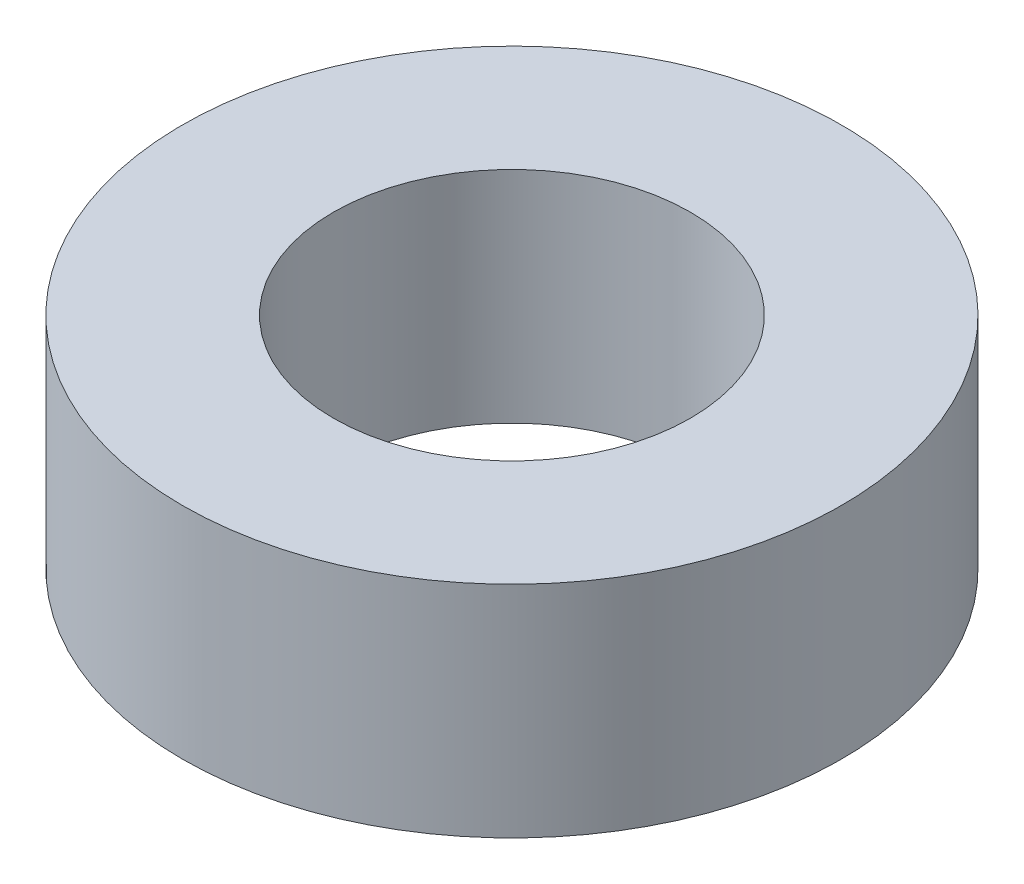
ISO-10303-21;
HEADER;
FILE_DESCRIPTION(('STEP AP214'),'2;1');
FILE_NAME('part.step','',(''),(''),'','','');
FILE_SCHEMA(('AUTOMOTIVE_DESIGN { 1 0 10303 214 1 1 1 1 }'));
ENDSEC;
DATA;
#1=APPLICATION_CONTEXT('core data for automotive mechanical design processes');
#2=APPLICATION_PROTOCOL_DEFINITION('international standard','automotive_design',2000,#1);
#3=PRODUCT_CONTEXT('',#1,'mechanical');
#4=PRODUCT('Part','Part','',(#3));
#5=PRODUCT_RELATED_PRODUCT_CATEGORY('part','',(#4));
#6=PRODUCT_DEFINITION_FORMATION('','',#4);
#7=PRODUCT_DEFINITION_CONTEXT('part definition',#1,'design');
#8=PRODUCT_DEFINITION('design','',#6,#7);
#9=PRODUCT_DEFINITION_SHAPE('','',#8);
#10=(LENGTH_UNIT() NAMED_UNIT(*) SI_UNIT(.MILLI.,.METRE.));
#11=(NAMED_UNIT(*) PLANE_ANGLE_UNIT() SI_UNIT($,.RADIAN.));
#12=(NAMED_UNIT(*) SI_UNIT($,.STERADIAN.) SOLID_ANGLE_UNIT());
#13=UNCERTAINTY_MEASURE_WITH_UNIT(LENGTH_MEASURE(1.E-05),#10,'distance_accuracy_value','');
#14=(GEOMETRIC_REPRESENTATION_CONTEXT(3) GLOBAL_UNCERTAINTY_ASSIGNED_CONTEXT((#13)) GLOBAL_UNIT_ASSIGNED_CONTEXT((#10,
#11,#12)) REPRESENTATION_CONTEXT('',''));
#15=CARTESIAN_POINT('',(0.,0.,0.));
#16=DIRECTION('',(0.,0.,1.));
#17=DIRECTION('',(1.,0.,0.));
#18=AXIS2_PLACEMENT_3D('',#15,#16,#17);
#19=CARTESIAN_POINT('',(0.,4.,0.));
#20=DIRECTION('',(0.,1.,0.));
#21=DIRECTION('',(0.,0.,1.));
#22=AXIS2_PLACEMENT_3D('',#19,#20,#21);
#23=PLANE('',#22);
#24=CARTESIAN_POINT('',(0.,4.,0.));
#25=DIRECTION('',(0.,1.,0.));
#26=DIRECTION('',(0.,0.,1.));
#27=AXIS2_PLACEMENT_3D('',#24,#25,#26);
#28=CIRCLE('',#27,6.);
#29=CARTESIAN_POINT('',(0.,4.,6.));
#30=VERTEX_POINT('',#29);
#31=EDGE_CURVE('E10',#30,#30,#28,.T.);
#32=ORIENTED_EDGE('',*,*,#31,.T.);
#33=EDGE_LOOP('',(#32));
#34=FACE_BOUND('',#33,.T.);
#35=CARTESIAN_POINT('',(0.,4.,0.));
#36=DIRECTION('',(0.,1.,0.));
#37=DIRECTION('',(0.,0.,1.));
#38=AXIS2_PLACEMENT_3D('',#35,#36,#37);
#39=CIRCLE('',#38,3.25);
#40=CARTESIAN_POINT('',(0.,4.,3.25));
#41=VERTEX_POINT('',#40);
#42=EDGE_CURVE('E48',#41,#41,#39,.T.);
#43=ORIENTED_EDGE('',*,*,#42,.F.);
#44=EDGE_LOOP('',(#43));
#45=FACE_BOUND('',#44,.T.);
#46=ADVANCED_FACE('F37',(#34,#45),#23,.T.);
#47=CARTESIAN_POINT('',(0.,0.,0.));
#48=DIRECTION('',(0.,1.,0.));
#49=DIRECTION('',(0.,0.,1.));
#50=AXIS2_PLACEMENT_3D('',#47,#48,#49);
#51=PLANE('',#50);
#52=CARTESIAN_POINT('',(0.,0.,0.));
#53=DIRECTION('',(0.,1.,0.));
#54=DIRECTION('',(0.,0.,1.));
#55=AXIS2_PLACEMENT_3D('',#52,#53,#54);
#56=CIRCLE('',#55,6.);
#57=CARTESIAN_POINT('',(0.,0.,6.));
#58=VERTEX_POINT('',#57);
#59=EDGE_CURVE('E41',#58,#58,#56,.T.);
#60=ORIENTED_EDGE('',*,*,#59,.F.);
#61=EDGE_LOOP('',(#60));
#62=FACE_BOUND('',#61,.T.);
#63=CARTESIAN_POINT('',(0.,0.,0.));
#64=DIRECTION('',(0.,1.,0.));
#65=DIRECTION('',(0.,0.,1.));
#66=AXIS2_PLACEMENT_3D('',#63,#64,#65);
#67=CIRCLE('',#66,3.25);
#68=CARTESIAN_POINT('',(0.,0.,3.25));
#69=VERTEX_POINT('',#68);
#70=EDGE_CURVE('E50',#69,#69,#67,.T.);
#71=ORIENTED_EDGE('',*,*,#70,.T.);
#72=EDGE_LOOP('',(#71));
#73=FACE_BOUND('',#72,.T.);
#74=ADVANCED_FACE('F60',(#62,#73),#51,.F.);
#75=CARTESIAN_POINT('',(0.,4.,0.));
#76=DIRECTION('',(0.,-1.,0.));
#77=DIRECTION('',(0.,0.,-1.));
#78=AXIS2_PLACEMENT_3D('',#75,#76,#77);
#79=CYLINDRICAL_SURFACE('',#78,6.);
#80=ORIENTED_EDGE('',*,*,#31,.F.);
#81=EDGE_LOOP('',(#80));
#82=FACE_BOUND('',#81,.T.);
#83=ORIENTED_EDGE('',*,*,#59,.T.);
#84=EDGE_LOOP('',(#83));
#85=FACE_BOUND('',#84,.T.);
#86=ADVANCED_FACE('F39',(#82,#85),#79,.T.);
#87=CARTESIAN_POINT('',(0.,4.,0.));
#88=DIRECTION('',(0.,-1.,0.));
#89=DIRECTION('',(0.,0.,-1.));
#90=AXIS2_PLACEMENT_3D('',#87,#88,#89);
#91=CYLINDRICAL_SURFACE('',#90,3.25);
#92=ORIENTED_EDGE('',*,*,#42,.T.);
#93=EDGE_LOOP('',(#92));
#94=FACE_BOUND('',#93,.T.);
#95=ORIENTED_EDGE('',*,*,#70,.F.);
#96=EDGE_LOOP('',(#95));
#97=FACE_BOUND('',#96,.T.);
#98=ADVANCED_FACE('F56',(#94,#97),#91,.F.);
#99=CLOSED_SHELL('',(#46,#74,#86,#98));
#100=MANIFOLD_SOLID_BREP('B2',#99);
#101=ADVANCED_BREP_SHAPE_REPRESENTATION('',(#18,#100),#14);
#102=SHAPE_DEFINITION_REPRESENTATION(#9,#101);
ENDSEC;
END-ISO-10303-21;
